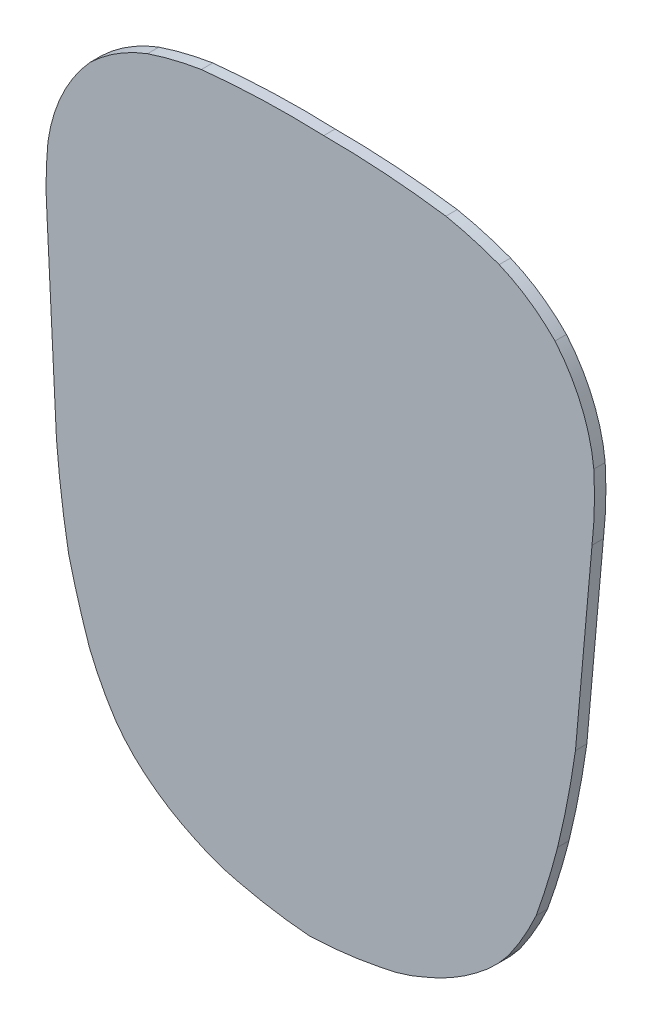
ISO-10303-21;
HEADER;
FILE_DESCRIPTION(('STEP AP214'),'2;1');
FILE_NAME('part.step','',(''),(''),'','','');
FILE_SCHEMA(('AUTOMOTIVE_DESIGN { 1 0 10303 214 1 1 1 1 }'));
ENDSEC;
DATA;
#1=APPLICATION_CONTEXT('core data for automotive mechanical design processes');
#2=APPLICATION_PROTOCOL_DEFINITION('international standard','automotive_design',2000,#1);
#3=PRODUCT_CONTEXT('',#1,'mechanical');
#4=PRODUCT('Part','Part','',(#3));
#5=PRODUCT_RELATED_PRODUCT_CATEGORY('part','',(#4));
#6=PRODUCT_DEFINITION_FORMATION('','',#4);
#7=PRODUCT_DEFINITION_CONTEXT('part definition',#1,'design');
#8=PRODUCT_DEFINITION('design','',#6,#7);
#9=PRODUCT_DEFINITION_SHAPE('','',#8);
#10=(LENGTH_UNIT() NAMED_UNIT(*) SI_UNIT(.MILLI.,.METRE.));
#11=(NAMED_UNIT(*) PLANE_ANGLE_UNIT() SI_UNIT($,.RADIAN.));
#12=(NAMED_UNIT(*) SI_UNIT($,.STERADIAN.) SOLID_ANGLE_UNIT());
#13=UNCERTAINTY_MEASURE_WITH_UNIT(LENGTH_MEASURE(1.E-05),#10,'distance_accuracy_value','');
#14=(GEOMETRIC_REPRESENTATION_CONTEXT(3) GLOBAL_UNCERTAINTY_ASSIGNED_CONTEXT((#13)) GLOBAL_UNIT_ASSIGNED_CONTEXT((#10,
#11,#12)) REPRESENTATION_CONTEXT('',''));
#15=CARTESIAN_POINT('',(0.,0.,0.));
#16=DIRECTION('',(0.,0.,1.));
#17=DIRECTION('',(1.,0.,0.));
#18=AXIS2_PLACEMENT_3D('',#15,#16,#17);
#19=CARTESIAN_POINT('',(-2.87645068487033,-22.2307778413904,43.1510965279302));
#20=DIRECTION('',(0.,0.,1.));
#21=DIRECTION('',(0.0193548335692301,0.999812677663925,0.));
#22=AXIS2_PLACEMENT_3D('',#19,#20,#21);
#23=PLANE('',#22);
#24=CARTESIAN_POINT('',(3.40605421210527,8.0200148488719,43.15109652793));
#25=DIRECTION('',(0.,0.,-1.));
#26=DIRECTION('',(-0.0193548335692301,-0.999812677663925,0.));
#27=AXIS2_PLACEMENT_3D('',#24,#25,#26);
#28=CIRCLE('',#27,7.43643173112);
#29=CARTESIAN_POINT('',(8.74976189327227,13.1916011731872,43.15109652793));
#30=VERTEX_POINT('',#29);
#31=CARTESIAN_POINT('',(6.29473617833653,14.8724621043842,43.1510965279299));
#32=VERTEX_POINT('',#31);
#33=EDGE_CURVE('E399',#30,#32,#28,.F.);
#34=ORIENTED_EDGE('',*,*,#33,.F.);
#35=CARTESIAN_POINT('',(3.11803650286176,8.43130453548574,43.1510965279299));
#36=DIRECTION('',(0.,0.,-1.));
#37=DIRECTION('',(-0.0193548335692301,-0.999812677663925,0.));
#38=AXIS2_PLACEMENT_3D('',#35,#36,#37);
#39=CIRCLE('',#38,7.3740595978);
#40=CARTESIAN_POINT('',(10.4553019723892,9.16702892789541,43.1510965279302));
#41=VERTEX_POINT('',#40);
#42=EDGE_CURVE('E194',#41,#30,#39,.F.);
#43=ORIENTED_EDGE('',*,*,#42,.F.);
#44=CARTESIAN_POINT('',(-6.32552371849111,8.14421174061843,43.1510965279296));
#45=DIRECTION('',(0.,0.,-1.));
#46=DIRECTION('',(-0.0193548335692301,-0.999812677663925,0.));
#47=AXIS2_PLACEMENT_3D('',#44,#45,#46);
#48=CIRCLE('',#47,16.81196793556);
#49=CARTESIAN_POINT('',(10.3766044314371,6.22557130278919,43.1510965279302));
#50=VERTEX_POINT('',#49);
#51=EDGE_CURVE('E20',#50,#41,#48,.F.);
#52=ORIENTED_EDGE('',*,*,#51,.F.);
#53=DIRECTION('',(-0.0886995040357044,-0.996058431008854,0.));
#54=VECTOR('',#53,1.);
#55=CARTESIAN_POINT('',(10.3766044314371,6.22557130278921,43.1510965279302));
#56=LINE('',#55,#54);
#57=CARTESIAN_POINT('',(9.64811099468465,-1.95510611475086,43.1510965279302));
#58=VERTEX_POINT('',#57);
#59=EDGE_CURVE('E193',#50,#58,#56,.T.);
#60=ORIENTED_EDGE('',*,*,#59,.T.);
#61=CARTESIAN_POINT('',(-31.2814474166913,3.80134354731974,43.1510965279289));
#62=DIRECTION('',(0.,0.,-1.));
#63=DIRECTION('',(-0.0193548335692301,-0.999812677663925,0.));
#64=AXIS2_PLACEMENT_3D('',#61,#62,#63);
#65=CIRCLE('',#64,41.33237791928);
#66=CARTESIAN_POINT('',(8.86403234955431,-6.0325732105216,43.1510965279303));
#67=VERTEX_POINT('',#66);
#68=EDGE_CURVE('E206',#67,#58,#65,.F.);
#69=ORIENTED_EDGE('',*,*,#68,.F.);
#70=CARTESIAN_POINT('',(-24.9737606237932,2.68335405814096,43.1510965279291));
#71=DIRECTION('',(0.,0.,-1.));
#72=DIRECTION('',(-0.0193548335692301,-0.999812677663925,0.));
#73=AXIS2_PLACEMENT_3D('',#70,#71,#72);
#74=CIRCLE('',#73,34.94228987144);
#75=CARTESIAN_POINT('',(7.9194767814797,-9.1064107597041,43.1510965279303));
#76=VERTEX_POINT('',#75);
#77=EDGE_CURVE('E319',#76,#67,#74,.F.);
#78=ORIENTED_EDGE('',*,*,#77,.F.);
#79=CARTESIAN_POINT('',(-3.58067037627316,-3.93497982202898,43.1510965279299));
#80=DIRECTION('',(0.,0.,-1.));
#81=DIRECTION('',(-0.0193548335692301,-0.999812677663925,0.));
#82=AXIS2_PLACEMENT_3D('',#79,#80,#81);
#83=CIRCLE('',#82,12.60940452968);
#84=CARTESIAN_POINT('',(6.69776683055133,-11.2391437836662,43.1510965279303));
#85=VERTEX_POINT('',#84);
#86=EDGE_CURVE('E323',#85,#76,#83,.F.);
#87=ORIENTED_EDGE('',*,*,#86,.F.);
#88=CARTESIAN_POINT('',(1.10266886694127,-6.86934474010801,43.15109652793));
#89=DIRECTION('',(0.,0.,-1.));
#90=DIRECTION('',(-0.0193548335692301,-0.999812677663925,0.));
#91=AXIS2_PLACEMENT_3D('',#88,#89,#90);
#92=CIRCLE('',#91,7.09931439672);
#93=CARTESIAN_POINT('',(5.3008399811585,-12.5943446701716,43.1510965279303));
#94=VERTEX_POINT('',#93);
#95=EDGE_CURVE('E327',#94,#85,#92,.F.);
#96=ORIENTED_EDGE('',*,*,#95,.F.);
#97=CARTESIAN_POINT('',(-0.638723059391969,-4.83953730632281,43.15109652793));
#98=DIRECTION('',(0.,0.,-1.));
#99=DIRECTION('',(-0.0193548335692301,-0.999812677663925,0.));
#100=AXIS2_PLACEMENT_3D('',#97,#98,#99);
#101=CIRCLE('',#100,9.76808304444);
#102=CARTESIAN_POINT('',(3.02325465351666,-13.8952187049386,43.1510965279302));
#103=VERTEX_POINT('',#102);
#104=EDGE_CURVE('E331',#103,#94,#101,.F.);
#105=ORIENTED_EDGE('',*,*,#104,.F.);
#106=CARTESIAN_POINT('',(-0.207770559998263,-6.83732878190931,43.15109652793));
#107=DIRECTION('',(0.,0.,-1.));
#108=DIRECTION('',(-0.0193548335692301,-0.999812677663925,0.));
#109=AXIS2_PLACEMENT_3D('',#106,#107,#108);
#110=CIRCLE('',#109,7.76230211316);
#111=CARTESIAN_POINT('',(1.11765382111094,-14.4856347581324,43.1510965279302));
#112=VERTEX_POINT('',#111);
#113=EDGE_CURVE('E335',#112,#103,#110,.F.);
#114=ORIENTED_EDGE('',*,*,#113,.F.);
#115=CARTESIAN_POINT('',(-2.80966912930602,4.75500909683415,43.1510965279298));
#116=DIRECTION('',(0.,0.,-1.));
#117=DIRECTION('',(-0.0193548335692301,-0.999812677663925,0.));
#118=AXIS2_PLACEMENT_3D('',#115,#116,#117);
#119=CIRCLE('',#118,19.6373684976);
#120=CARTESIAN_POINT('',(-2.0152683231092,-14.8662846645274,43.1510965279301));
#121=VERTEX_POINT('',#120);
#122=EDGE_CURVE('E339',#121,#112,#119,.F.);
#123=ORIENTED_EDGE('',*,*,#122,.F.);
#124=CARTESIAN_POINT('',(-0.523207579480698,4.71400533480683,43.1510965279299));
#125=DIRECTION('',(0.,0.,-1.));
#126=DIRECTION('',(-0.0193548335692301,-0.999812677663925,0.));
#127=AXIS2_PLACEMENT_3D('',#124,#125,#126);
#128=CIRCLE('',#127,19.63705684976);
#129=CARTESIAN_POINT('',(-5.17633782189568,-14.3637927736707,43.15109652793));
#130=VERTEX_POINT('',#129);
#131=EDGE_CURVE('E343',#130,#121,#128,.F.);
#132=ORIENTED_EDGE('',*,*,#131,.F.);
#133=CARTESIAN_POINT('',(-3.55589855490564,-6.77251418057686,43.1510965279299));
#134=DIRECTION('',(0.,0.,-1.));
#135=DIRECTION('',(-0.0193548335692301,-0.999812677663925,0.));
#136=AXIS2_PLACEMENT_3D('',#133,#134,#135);
#137=CIRCLE('',#136,7.76230211316);
#138=CARTESIAN_POINT('',(-7.05766041396093,-13.7000677154428,43.1510965279299));
#139=VERTEX_POINT('',#138);
#140=EDGE_CURVE('E347',#139,#130,#137,.F.);
#141=ORIENTED_EDGE('',*,*,#140,.F.);
#142=CARTESIAN_POINT('',(-3.04794957670783,-4.79289839153911,43.1510965279299));
#143=DIRECTION('',(0.,0.,-1.));
#144=DIRECTION('',(-0.0193548335692301,-0.999812677663925,0.));
#145=AXIS2_PLACEMENT_3D('',#142,#143,#144);
#146=CIRCLE('',#145,9.76808304444);
#147=CARTESIAN_POINT('',(-9.28319236302841,-12.3120202657152,43.1510965279298));
#148=VERTEX_POINT('',#147);
#149=EDGE_CURVE('E351',#148,#139,#146,.F.);
#150=ORIENTED_EDGE('',*,*,#149,.F.);
#151=CARTESIAN_POINT('',(-4.76167465689602,-6.83879977530856,43.1510965279299));
#152=DIRECTION('',(0.,0.,-1.));
#153=DIRECTION('',(-0.0193548335692301,-0.999812677663925,0.));
#154=AXIS2_PLACEMENT_3D('',#151,#152,#153);
#155=CIRCLE('',#154,7.09931439672);
#156=CARTESIAN_POINT('',(-10.5813963887555,-10.9046457963967,43.1510965279297));
#157=VERTEX_POINT('',#156);
#158=EDGE_CURVE('E355',#157,#148,#155,.F.);
#159=ORIENTED_EDGE('',*,*,#158,.F.);
#160=CARTESIAN_POINT('',(-0.0279711922389993,-4.00375460651079,43.15109652793));
#161=DIRECTION('',(0.,0.,-1.));
#162=DIRECTION('',(-0.0193548335692301,-0.999812677663925,0.));
#163=AXIS2_PLACEMENT_3D('',#160,#161,#162);
#164=CIRCLE('',#163,12.60940452968);
#165=CARTESIAN_POINT('',(-11.7196490905641,-8.726227530195,43.1510965279297));
#166=VERTEX_POINT('',#165);
#167=EDGE_CURVE('E359',#166,#157,#164,.F.);
#168=ORIENTED_EDGE('',*,*,#167,.F.);
#169=CARTESIAN_POINT('',(21.3074102324665,2.68328490166436,43.1510965279306));
#170=DIRECTION('',(0.,0.,-1.));
#171=DIRECTION('',(-0.0193548335692301,-0.999812677663925,0.));
#172=AXIS2_PLACEMENT_3D('',#169,#170,#171);
#173=CIRCLE('',#172,34.94228987144);
#174=CARTESIAN_POINT('',(-12.6348799299237,-5.61638738053107,43.1510965279296));
#175=VERTEX_POINT('',#174);
#176=EDGE_CURVE('E363',#175,#166,#173,.F.);
#177=ORIENTED_EDGE('',*,*,#176,.F.);
#178=CARTESIAN_POINT('',(28.0310735031442,1.7758853310058,43.1510965279308));
#179=DIRECTION('',(0.,0.,-1.));
#180=DIRECTION('',(-0.0193548335692301,-0.999812677663925,0.));
#181=AXIS2_PLACEMENT_3D('',#178,#179,#180);
#182=CIRCLE('',#181,41.33237791928);
#183=CARTESIAN_POINT('',(-13.1702154109104,-1.51337845938613,43.1510965279295));
#184=VERTEX_POINT('',#183);
#185=EDGE_CURVE('E367',#184,#175,#182,.F.);
#186=ORIENTED_EDGE('',*,*,#185,.F.);
#187=DIRECTION('',(-0.0500831809567766,0.998745050042928,0.));
#188=VECTOR('',#187,1.);
#189=CARTESIAN_POINT('',(-13.1702154109104,-1.51337845938573,43.1510965279295));
#190=LINE('',#189,#188);
#191=CARTESIAN_POINT('',(-13.5815510662261,6.68936429385884,43.1510965279294));
#192=VERTEX_POINT('',#191);
#193=EDGE_CURVE('E218',#184,#192,#190,.T.);
#194=ORIENTED_EDGE('',*,*,#193,.T.);
#195=CARTESIAN_POINT('',(3.18231954948565,7.96015453853935,43.1510965279299));
#196=DIRECTION('',(0.,0.,-1.));
#197=DIRECTION('',(-0.0193548335692301,-0.999812677663925,0.));
#198=AXIS2_PLACEMENT_3D('',#195,#196,#197);
#199=CIRCLE('',#198,16.81196793556);
#200=CARTESIAN_POINT('',(-13.5463481289567,9.63166390750378,43.1510965279294));
#201=VERTEX_POINT('',#200);
#202=EDGE_CURVE('E222',#201,#192,#199,.F.);
#203=ORIENTED_EDGE('',*,*,#202,.F.);
#204=CARTESIAN_POINT('',(-6.24305419079957,8.61252083374835,43.1510965279296));
#205=DIRECTION('',(0.,0.,-1.));
#206=DIRECTION('',(-0.0193548335692301,-0.999812677663925,0.));
#207=AXIS2_PLACEMENT_3D('',#204,#205,#206);
#208=CIRCLE('',#207,7.3740595978);
#209=CARTESIAN_POINT('',(-11.6863252040828,13.5872123445716,43.1510965279294));
#210=VERTEX_POINT('',#209);
#211=EDGE_CURVE('E375',#210,#201,#208,.F.);
#212=ORIENTED_EDGE('',*,*,#211,.F.);
#213=CARTESIAN_POINT('',(-6.54677401618405,8.21268627443511,43.1510965279296));
#214=DIRECTION('',(0.,0.,-1.));
#215=DIRECTION('',(-0.0193548335692301,-0.999812677663925,0.));
#216=AXIS2_PLACEMENT_3D('',#213,#214,#215);
#217=CIRCLE('',#216,7.43643173112);
#218=CARTESIAN_POINT('',(-9.16808546254474,15.17179851615,43.1510965279294));
#219=VERTEX_POINT('',#218);
#220=EDGE_CURVE('E379',#219,#210,#217,.F.);
#221=ORIENTED_EDGE('',*,*,#220,.F.);
#222=CARTESIAN_POINT('',(-4.43670572158524,1.02428534892838,43.1510965279298));
#223=DIRECTION('',(0.,0.,-1.));
#224=DIRECTION('',(-0.0193548335692301,-0.999812677663925,0.));
#225=AXIS2_PLACEMENT_3D('',#222,#223,#224);
#226=CIRCLE('',#225,14.91771038296);
#227=CARTESIAN_POINT('',(-6.80003650135285,15.7536013783737,43.1510965279295));
#228=VERTEX_POINT('',#227);
#229=EDGE_CURVE('E383',#228,#219,#226,.F.);
#230=ORIENTED_EDGE('',*,*,#229,.F.);
#231=CARTESIAN_POINT('',(-2.87645068487033,-22.2307778413904,43.1510965279302));
#232=DIRECTION('',(0.,0.,-1.));
#233=DIRECTION('',(-0.0193548335692301,-0.999812677663925,0.));
#234=AXIS2_PLACEMENT_3D('',#231,#232,#233);
#235=CIRCLE('',#234,38.18648439396);
#236=CARTESIAN_POINT('',(-1.41914055333825,15.9278887698879,43.1510965279297));
#237=VERTEX_POINT('',#236);
#238=EDGE_CURVE('E387',#237,#228,#235,.F.);
#239=ORIENTED_EDGE('',*,*,#238,.F.);
#240=CARTESIAN_POINT('',(-1.43975485684221,-22.2585901013477,43.1510965279302));
#241=DIRECTION('',(0.,0.,-1.));
#242=DIRECTION('',(-0.0193548335692301,-0.999812677663925,0.));
#243=AXIS2_PLACEMENT_3D('',#240,#241,#242);
#244=CIRCLE('',#243,38.186484435371);
#245=CARTESIAN_POINT('',(3.95097858118645,15.5454782846469,43.1510965279299));
#246=VERTEX_POINT('',#245);
#247=EDGE_CURVE('E391',#246,#237,#244,.F.);
#248=ORIENTED_EDGE('',*,*,#247,.F.);
#249=CARTESIAN_POINT('',(1.019358338455,0.918664351931352,43.15109652793));
#250=DIRECTION('',(0.,0.,-1.));
#251=DIRECTION('',(-0.0193548335692301,-0.999812677663925,0.));
#252=AXIS2_PLACEMENT_3D('',#249,#250,#251);
#253=CIRCLE('',#252,14.91771038296);
#254=EDGE_CURVE('E395',#32,#246,#253,.F.);
#255=ORIENTED_EDGE('',*,*,#254,.F.);
#256=EDGE_LOOP('',(#34,#43,#52,#60,#69,#78,#87,#96,#105,#114,#123,#132,#141,#150,#159,#168,#177,
#186,#194,#203,#212,#221,#230,#239,#248,#255));
#257=FACE_BOUND('',#256,.T.);
#258=ADVANCED_FACE('F17',(#257),#23,.F.);
#259=CARTESIAN_POINT('',(-6.32552371849112,8.14421174061844,43.5320965279296));
#260=DIRECTION('',(0.,0.,-1.));
#261=DIRECTION('',(-0.0193548335692301,-0.999812677663925,0.));
#262=AXIS2_PLACEMENT_3D('',#259,#260,#261);
#263=CYLINDRICAL_SURFACE('',#262,16.81196793556);
#264=DIRECTION('',(0.,0.,-1.));
#265=VECTOR('',#264,1.);
#266=CARTESIAN_POINT('',(10.4553019723892,9.16702892789546,43.5320965279302));
#267=LINE('',#266,#265);
#268=CARTESIAN_POINT('',(10.4553019723892,9.16702892789545,43.6520965279302));
#269=VERTEX_POINT('',#268);
#270=EDGE_CURVE('E198',#269,#41,#267,.T.);
#271=ORIENTED_EDGE('',*,*,#270,.F.);
#272=CARTESIAN_POINT('',(-6.32552371849113,8.14421174061844,43.6520965279296));
#273=DIRECTION('',(0.,0.,-1.));
#274=DIRECTION('',(-0.0193548335692301,-0.999812677663925,0.));
#275=AXIS2_PLACEMENT_3D('',#272,#273,#274);
#276=CIRCLE('',#275,16.81196793556);
#277=CARTESIAN_POINT('',(10.3766044314371,6.22557130278932,43.6520965279302));
#278=VERTEX_POINT('',#277);
#279=EDGE_CURVE('E203',#278,#269,#276,.F.);
#280=ORIENTED_EDGE('',*,*,#279,.F.);
#281=DIRECTION('',(0.,0.,1.));
#282=VECTOR('',#281,1.);
#283=CARTESIAN_POINT('',(10.3766044314371,6.22557130278923,43.5320965279302));
#284=LINE('',#283,#282);
#285=EDGE_CURVE('E200',#278,#50,#284,.F.);
#286=ORIENTED_EDGE('',*,*,#285,.T.);
#287=ORIENTED_EDGE('',*,*,#51,.T.);
#288=EDGE_LOOP('',(#271,#280,#286,#287));
#289=FACE_BOUND('',#288,.T.);
#290=ADVANCED_FACE('F201',(#289),#263,.T.);
#291=CARTESIAN_POINT('',(3.11803650286175,8.43130453548575,43.5320965279299));
#292=DIRECTION('',(0.,0.,-1.));
#293=DIRECTION('',(-0.0193548335692301,-0.999812677663925,0.));
#294=AXIS2_PLACEMENT_3D('',#291,#292,#293);
#295=CYLINDRICAL_SURFACE('',#294,7.3740595978);
#296=DIRECTION('',(0.,0.,-1.));
#297=VECTOR('',#296,1.);
#298=CARTESIAN_POINT('',(8.74976189327226,13.1916011731872,43.53209652793));
#299=LINE('',#298,#297);
#300=CARTESIAN_POINT('',(8.74976189327226,13.1916011731872,43.65209652793));
#301=VERTEX_POINT('',#300);
#302=EDGE_CURVE('E401',#301,#30,#299,.T.);
#303=ORIENTED_EDGE('',*,*,#302,.F.);
#304=CARTESIAN_POINT('',(3.11803650286175,8.43130453548575,43.6520965279299));
#305=DIRECTION('',(0.,0.,-1.));
#306=DIRECTION('',(-0.0193548335692301,-0.999812677663925,0.));
#307=AXIS2_PLACEMENT_3D('',#304,#305,#306);
#308=CIRCLE('',#307,7.3740595978);
#309=EDGE_CURVE('E310',#269,#301,#308,.F.);
#310=ORIENTED_EDGE('',*,*,#309,.F.);
#311=ORIENTED_EDGE('',*,*,#270,.T.);
#312=ORIENTED_EDGE('',*,*,#42,.T.);
#313=EDGE_LOOP('',(#303,#310,#311,#312));
#314=FACE_BOUND('',#313,.T.);
#315=ADVANCED_FACE('F408',(#314),#295,.T.);
#316=CARTESIAN_POINT('',(3.40605421210526,8.02001484887191,43.53209652793));
#317=DIRECTION('',(0.,0.,-1.));
#318=DIRECTION('',(-0.0193548335692301,-0.999812677663925,0.));
#319=AXIS2_PLACEMENT_3D('',#316,#317,#318);
#320=CYLINDRICAL_SURFACE('',#319,7.43643173112);
#321=DIRECTION('',(0.,0.,-1.));
#322=VECTOR('',#321,1.);
#323=CARTESIAN_POINT('',(6.29473617833652,14.8724621043842,43.5320965279299));
#324=LINE('',#323,#322);
#325=CARTESIAN_POINT('',(6.29473617833651,14.8724621043842,43.6520965279299));
#326=VERTEX_POINT('',#325);
#327=EDGE_CURVE('E398',#326,#32,#324,.T.);
#328=ORIENTED_EDGE('',*,*,#327,.F.);
#329=CARTESIAN_POINT('',(3.40605421210526,8.02001484887191,43.6520965279299));
#330=DIRECTION('',(0.,0.,-1.));
#331=DIRECTION('',(-0.0193548335692301,-0.999812677663925,0.));
#332=AXIS2_PLACEMENT_3D('',#329,#330,#331);
#333=CIRCLE('',#332,7.43643173112);
#334=EDGE_CURVE('E306',#301,#326,#333,.F.);
#335=ORIENTED_EDGE('',*,*,#334,.F.);
#336=ORIENTED_EDGE('',*,*,#302,.T.);
#337=ORIENTED_EDGE('',*,*,#33,.T.);
#338=EDGE_LOOP('',(#328,#335,#336,#337));
#339=FACE_BOUND('',#338,.T.);
#340=ADVANCED_FACE('F486',(#339),#320,.T.);
#341=CARTESIAN_POINT('',(1.01935833845499,0.918664351931359,43.53209652793));
#342=DIRECTION('',(0.,0.,-1.));
#343=DIRECTION('',(-0.0193548335692301,-0.999812677663925,0.));
#344=AXIS2_PLACEMENT_3D('',#341,#342,#343);
#345=CYLINDRICAL_SURFACE('',#344,14.91771038296);
#346=DIRECTION('',(0.,0.,-1.));
#347=VECTOR('',#346,1.);
#348=CARTESIAN_POINT('',(3.95097858118647,15.5454782846469,43.5320965279299));
#349=LINE('',#348,#347);
#350=CARTESIAN_POINT('',(3.95097858118645,15.5454782846469,43.6520965279299));
#351=VERTEX_POINT('',#350);
#352=EDGE_CURVE('E394',#351,#246,#349,.T.);
#353=ORIENTED_EDGE('',*,*,#352,.F.);
#354=CARTESIAN_POINT('',(1.01935833845498,0.91866435193136,43.6520965279299));
#355=DIRECTION('',(0.,0.,-1.));
#356=DIRECTION('',(-0.0193548335692301,-0.999812677663925,0.));
#357=AXIS2_PLACEMENT_3D('',#354,#355,#356);
#358=CIRCLE('',#357,14.91771038296);
#359=EDGE_CURVE('E302',#326,#351,#358,.F.);
#360=ORIENTED_EDGE('',*,*,#359,.F.);
#361=ORIENTED_EDGE('',*,*,#327,.T.);
#362=ORIENTED_EDGE('',*,*,#254,.T.);
#363=EDGE_LOOP('',(#353,#360,#361,#362));
#364=FACE_BOUND('',#363,.T.);
#365=ADVANCED_FACE('F482',(#364),#345,.T.);
#366=CARTESIAN_POINT('',(-1.43975485684222,-22.2585901013477,43.5320965279302));
#367=DIRECTION('',(0.,0.,-1.));
#368=DIRECTION('',(-0.0193548335692301,-0.999812677663925,0.));
#369=AXIS2_PLACEMENT_3D('',#366,#367,#368);
#370=CYLINDRICAL_SURFACE('',#369,38.186484435371);
#371=DIRECTION('',(0.,0.,-1.));
#372=VECTOR('',#371,1.);
#373=CARTESIAN_POINT('',(-1.41914055333816,15.9278887698879,43.5320965279297));
#374=LINE('',#373,#372);
#375=CARTESIAN_POINT('',(-1.41914055333827,15.9278887698879,43.6520965279297));
#376=VERTEX_POINT('',#375);
#377=EDGE_CURVE('E390',#376,#237,#374,.T.);
#378=ORIENTED_EDGE('',*,*,#377,.F.);
#379=CARTESIAN_POINT('',(-1.43975485684222,-22.2585901013477,43.6520965279302));
#380=DIRECTION('',(0.,0.,-1.));
#381=DIRECTION('',(-0.0193548335692301,-0.999812677663925,0.));
#382=AXIS2_PLACEMENT_3D('',#379,#380,#381);
#383=CIRCLE('',#382,38.186484435371);
#384=EDGE_CURVE('E298',#351,#376,#383,.F.);
#385=ORIENTED_EDGE('',*,*,#384,.F.);
#386=ORIENTED_EDGE('',*,*,#352,.T.);
#387=ORIENTED_EDGE('',*,*,#247,.T.);
#388=EDGE_LOOP('',(#378,#385,#386,#387));
#389=FACE_BOUND('',#388,.T.);
#390=ADVANCED_FACE('F491',(#389),#370,.T.);
#391=CARTESIAN_POINT('',(-2.87645068487034,-22.2307778413904,43.5320965279302));
#392=DIRECTION('',(0.,0.,-1.));
#393=DIRECTION('',(-0.0193548335692301,-0.999812677663925,0.));
#394=AXIS2_PLACEMENT_3D('',#391,#392,#393);
#395=CYLINDRICAL_SURFACE('',#394,38.18648439396);
#396=DIRECTION('',(0.,0.,-1.));
#397=VECTOR('',#396,1.);
#398=CARTESIAN_POINT('',(-6.80003650135287,15.7536013783737,43.5320965279295));
#399=LINE('',#398,#397);
#400=CARTESIAN_POINT('',(-6.80003650135289,15.7536013783737,43.6520965279295));
#401=VERTEX_POINT('',#400);
#402=EDGE_CURVE('E386',#401,#228,#399,.T.);
#403=ORIENTED_EDGE('',*,*,#402,.F.);
#404=CARTESIAN_POINT('',(-2.87645068487035,-22.2307778413904,43.6520965279302));
#405=DIRECTION('',(0.,0.,-1.));
#406=DIRECTION('',(-0.0193548335692301,-0.999812677663925,0.));
#407=AXIS2_PLACEMENT_3D('',#404,#405,#406);
#408=CIRCLE('',#407,38.18648439396);
#409=EDGE_CURVE('E294',#376,#401,#408,.F.);
#410=ORIENTED_EDGE('',*,*,#409,.F.);
#411=ORIENTED_EDGE('',*,*,#377,.T.);
#412=ORIENTED_EDGE('',*,*,#238,.T.);
#413=EDGE_LOOP('',(#403,#410,#411,#412));
#414=FACE_BOUND('',#413,.T.);
#415=ADVANCED_FACE('F495',(#414),#395,.T.);
#416=CARTESIAN_POINT('',(-4.43670572158525,1.02428534892838,43.5320965279298));
#417=DIRECTION('',(0.,0.,-1.));
#418=DIRECTION('',(-0.0193548335692301,-0.999812677663925,0.));
#419=AXIS2_PLACEMENT_3D('',#416,#417,#418);
#420=CYLINDRICAL_SURFACE('',#419,14.91771038296);
#421=DIRECTION('',(0.,0.,-1.));
#422=VECTOR('',#421,1.);
#423=CARTESIAN_POINT('',(-9.16808546254472,15.17179851615,43.5320965279294));
#424=LINE('',#423,#422);
#425=CARTESIAN_POINT('',(-9.16808546254475,15.17179851615,43.6520965279295));
#426=VERTEX_POINT('',#425);
#427=EDGE_CURVE('E382',#426,#219,#424,.T.);
#428=ORIENTED_EDGE('',*,*,#427,.F.);
#429=CARTESIAN_POINT('',(-4.43670572158526,1.02428534892839,43.6520965279298));
#430=DIRECTION('',(0.,0.,-1.));
#431=DIRECTION('',(-0.0193548335692301,-0.999812677663925,0.));
#432=AXIS2_PLACEMENT_3D('',#429,#430,#431);
#433=CIRCLE('',#432,14.91771038296);
#434=EDGE_CURVE('E290',#401,#426,#433,.F.);
#435=ORIENTED_EDGE('',*,*,#434,.F.);
#436=ORIENTED_EDGE('',*,*,#402,.T.);
#437=ORIENTED_EDGE('',*,*,#229,.T.);
#438=EDGE_LOOP('',(#428,#435,#436,#437));
#439=FACE_BOUND('',#438,.T.);
#440=ADVANCED_FACE('F497',(#439),#420,.T.);
#441=CARTESIAN_POINT('',(-6.54677401618406,8.21268627443511,43.5320965279296));
#442=DIRECTION('',(0.,0.,-1.));
#443=DIRECTION('',(-0.0193548335692301,-0.999812677663925,0.));
#444=AXIS2_PLACEMENT_3D('',#441,#442,#443);
#445=CYLINDRICAL_SURFACE('',#444,7.43643173112);
#446=DIRECTION('',(0.,0.,-1.));
#447=VECTOR('',#446,1.);
#448=CARTESIAN_POINT('',(-11.6863252040828,13.5872123445716,43.5320965279294));
#449=LINE('',#448,#447);
#450=CARTESIAN_POINT('',(-11.6863252040828,13.5872123445716,43.6520965279294));
#451=VERTEX_POINT('',#450);
#452=EDGE_CURVE('E378',#451,#210,#449,.T.);
#453=ORIENTED_EDGE('',*,*,#452,.F.);
#454=CARTESIAN_POINT('',(-6.54677401618406,8.21268627443511,43.6520965279296));
#455=DIRECTION('',(0.,0.,-1.));
#456=DIRECTION('',(-0.0193548335692301,-0.999812677663925,0.));
#457=AXIS2_PLACEMENT_3D('',#454,#455,#456);
#458=CIRCLE('',#457,7.43643173112);
#459=EDGE_CURVE('E286',#426,#451,#458,.F.);
#460=ORIENTED_EDGE('',*,*,#459,.F.);
#461=ORIENTED_EDGE('',*,*,#427,.T.);
#462=ORIENTED_EDGE('',*,*,#220,.T.);
#463=EDGE_LOOP('',(#453,#460,#461,#462));
#464=FACE_BOUND('',#463,.T.);
#465=ADVANCED_FACE('F501',(#464),#445,.T.);
#466=CARTESIAN_POINT('',(-6.24305419079959,8.61252083374836,43.5320965279296));
#467=DIRECTION('',(0.,0.,-1.));
#468=DIRECTION('',(-0.0193548335692301,-0.999812677663925,0.));
#469=AXIS2_PLACEMENT_3D('',#466,#467,#468);
#470=CYLINDRICAL_SURFACE('',#469,7.3740595978);
#471=DIRECTION('',(0.,0.,-1.));
#472=VECTOR('',#471,1.);
#473=CARTESIAN_POINT('',(-13.5463481289567,9.63166390750379,43.5320965279294));
#474=LINE('',#473,#472);
#475=CARTESIAN_POINT('',(-13.5463481289567,9.63166390750378,43.6520965279294));
#476=VERTEX_POINT('',#475);
#477=EDGE_CURVE('E374',#476,#201,#474,.T.);
#478=ORIENTED_EDGE('',*,*,#477,.F.);
#479=CARTESIAN_POINT('',(-6.24305419079959,8.61252083374836,43.6520965279296));
#480=DIRECTION('',(0.,0.,-1.));
#481=DIRECTION('',(-0.0193548335692301,-0.999812677663925,0.));
#482=AXIS2_PLACEMENT_3D('',#479,#480,#481);
#483=CIRCLE('',#482,7.3740595978);
#484=EDGE_CURVE('E282',#451,#476,#483,.F.);
#485=ORIENTED_EDGE('',*,*,#484,.F.);
#486=ORIENTED_EDGE('',*,*,#452,.T.);
#487=ORIENTED_EDGE('',*,*,#211,.T.);
#488=EDGE_LOOP('',(#478,#485,#486,#487));
#489=FACE_BOUND('',#488,.T.);
#490=ADVANCED_FACE('F506',(#489),#470,.T.);
#491=CARTESIAN_POINT('',(3.18231954948564,7.96015453853935,43.5320965279299));
#492=DIRECTION('',(0.,0.,-1.));
#493=DIRECTION('',(-0.0193548335692301,-0.999812677663925,0.));
#494=AXIS2_PLACEMENT_3D('',#491,#492,#493);
#495=CYLINDRICAL_SURFACE('',#494,16.81196793556);
#496=DIRECTION('',(0.,0.,1.));
#497=VECTOR('',#496,1.);
#498=CARTESIAN_POINT('',(-13.5815510662261,6.68936429385887,43.5320965279294));
#499=LINE('',#498,#497);
#500=CARTESIAN_POINT('',(-13.5815510662261,6.68936429385886,43.6520965279294));
#501=VERTEX_POINT('',#500);
#502=EDGE_CURVE('E221',#192,#501,#499,.T.);
#503=ORIENTED_EDGE('',*,*,#502,.T.);
#504=CARTESIAN_POINT('',(3.18231954948563,7.96015453853936,43.6520965279299));
#505=DIRECTION('',(0.,0.,-1.));
#506=DIRECTION('',(-0.0193548335692301,-0.999812677663925,0.));
#507=AXIS2_PLACEMENT_3D('',#504,#505,#506);
#508=CIRCLE('',#507,16.81196793556);
#509=EDGE_CURVE('E278',#476,#501,#508,.F.);
#510=ORIENTED_EDGE('',*,*,#509,.F.);
#511=ORIENTED_EDGE('',*,*,#477,.T.);
#512=ORIENTED_EDGE('',*,*,#202,.T.);
#513=EDGE_LOOP('',(#503,#510,#511,#512));
#514=FACE_BOUND('',#513,.T.);
#515=ADVANCED_FACE('F510',(#514),#495,.T.);
#516=CARTESIAN_POINT('',(-13.1702154109105,-1.51337845938573,43.5320965279295));
#517=DIRECTION('',(0.998745050042928,0.0500831809567766,0.));
#518=DIRECTION('',(-0.0500831809567766,0.998745050042928,0.));
#519=AXIS2_PLACEMENT_3D('',#516,#517,#518);
#520=PLANE('',#519);
#521=ORIENTED_EDGE('',*,*,#502,.F.);
#522=ORIENTED_EDGE('',*,*,#193,.F.);
#523=DIRECTION('',(0.,0.,-1.));
#524=VECTOR('',#523,1.);
#525=CARTESIAN_POINT('',(-13.1702154109104,-1.51337845938593,43.5320965279295));
#526=LINE('',#525,#524);
#527=CARTESIAN_POINT('',(-13.1702154109104,-1.51337845938599,43.6520965279296));
#528=VERTEX_POINT('',#527);
#529=EDGE_CURVE('E370',#528,#184,#526,.T.);
#530=ORIENTED_EDGE('',*,*,#529,.F.);
#531=DIRECTION('',(0.050083180956776,-0.998745050042928,0.));
#532=VECTOR('',#531,1.);
#533=CARTESIAN_POINT('',(-13.5815510662261,6.68936429385881,43.6520965279294));
#534=LINE('',#533,#532);
#535=EDGE_CURVE('E277',#501,#528,#534,.T.);
#536=ORIENTED_EDGE('',*,*,#535,.F.);
#537=EDGE_LOOP('',(#521,#522,#530,#536));
#538=FACE_BOUND('',#537,.T.);
#539=ADVANCED_FACE('F514',(#538),#520,.F.);
#540=CARTESIAN_POINT('',(28.0310735031442,1.77588533100581,43.5320965279308));
#541=DIRECTION('',(0.,0.,-1.));
#542=DIRECTION('',(-0.0193548335692301,-0.999812677663925,0.));
#543=AXIS2_PLACEMENT_3D('',#540,#541,#542);
#544=CYLINDRICAL_SURFACE('',#543,41.33237791928);
#545=DIRECTION('',(0.,0.,-1.));
#546=VECTOR('',#545,1.);
#547=CARTESIAN_POINT('',(-12.6348799299237,-5.61638738053115,43.5320965279296));
#548=LINE('',#547,#546);
#549=CARTESIAN_POINT('',(-12.6348799299238,-5.61638738053106,43.6520965279296));
#550=VERTEX_POINT('',#549);
#551=EDGE_CURVE('E366',#550,#175,#548,.T.);
#552=ORIENTED_EDGE('',*,*,#551,.F.);
#553=CARTESIAN_POINT('',(28.0310735031442,1.77588533100581,43.6520965279308));
#554=DIRECTION('',(0.,0.,-1.));
#555=DIRECTION('',(-0.0193548335692301,-0.999812677663925,0.));
#556=AXIS2_PLACEMENT_3D('',#553,#554,#555);
#557=CIRCLE('',#556,41.33237791928);
#558=EDGE_CURVE('E273',#528,#550,#557,.F.);
#559=ORIENTED_EDGE('',*,*,#558,.F.);
#560=ORIENTED_EDGE('',*,*,#529,.T.);
#561=ORIENTED_EDGE('',*,*,#185,.T.);
#562=EDGE_LOOP('',(#552,#559,#560,#561));
#563=FACE_BOUND('',#562,.T.);
#564=ADVANCED_FACE('F522',(#563),#544,.T.);
#565=CARTESIAN_POINT('',(21.3074102324665,2.68328490166436,43.5320965279306));
#566=DIRECTION('',(0.,0.,-1.));
#567=DIRECTION('',(-0.0193548335692301,-0.999812677663925,0.));
#568=AXIS2_PLACEMENT_3D('',#565,#566,#567);
#569=CYLINDRICAL_SURFACE('',#568,34.94228987144);
#570=DIRECTION('',(0.,0.,-1.));
#571=VECTOR('',#570,1.);
#572=CARTESIAN_POINT('',(-11.7196490905641,-8.72622753019495,43.5320965279297));
#573=LINE('',#572,#571);
#574=CARTESIAN_POINT('',(-11.7196490905641,-8.72622753019496,43.6520965279297));
#575=VERTEX_POINT('',#574);
#576=EDGE_CURVE('E362',#575,#166,#573,.T.);
#577=ORIENTED_EDGE('',*,*,#576,.F.);
#578=CARTESIAN_POINT('',(21.3074102324665,2.68328490166437,43.6520965279306));
#579=DIRECTION('',(0.,0.,-1.));
#580=DIRECTION('',(-0.0193548335692301,-0.999812677663925,0.));
#581=AXIS2_PLACEMENT_3D('',#578,#579,#580);
#582=CIRCLE('',#581,34.94228987144);
#583=EDGE_CURVE('E269',#550,#575,#582,.F.);
#584=ORIENTED_EDGE('',*,*,#583,.F.);
#585=ORIENTED_EDGE('',*,*,#551,.T.);
#586=ORIENTED_EDGE('',*,*,#176,.T.);
#587=EDGE_LOOP('',(#577,#584,#585,#586));
#588=FACE_BOUND('',#587,.T.);
#589=ADVANCED_FACE('F526',(#588),#569,.T.);
#590=CARTESIAN_POINT('',(-0.0279711922390115,-4.00375460651078,43.53209652793));
#591=DIRECTION('',(0.,0.,-1.));
#592=DIRECTION('',(-0.0193548335692301,-0.999812677663925,0.));
#593=AXIS2_PLACEMENT_3D('',#590,#591,#592);
#594=CYLINDRICAL_SURFACE('',#593,12.60940452968);
#595=DIRECTION('',(0.,0.,-1.));
#596=VECTOR('',#595,1.);
#597=CARTESIAN_POINT('',(-10.5813963887555,-10.9046457963967,43.5320965279297));
#598=LINE('',#597,#596);
#599=CARTESIAN_POINT('',(-10.5813963887555,-10.9046457963967,43.6520965279297));
#600=VERTEX_POINT('',#599);
#601=EDGE_CURVE('E358',#600,#157,#598,.T.);
#602=ORIENTED_EDGE('',*,*,#601,.F.);
#603=CARTESIAN_POINT('',(-0.0279711922390154,-4.00375460651078,43.65209652793));
#604=DIRECTION('',(0.,0.,-1.));
#605=DIRECTION('',(-0.0193548335692301,-0.999812677663925,0.));
#606=AXIS2_PLACEMENT_3D('',#603,#604,#605);
#607=CIRCLE('',#606,12.60940452968);
#608=EDGE_CURVE('E265',#575,#600,#607,.F.);
#609=ORIENTED_EDGE('',*,*,#608,.F.);
#610=ORIENTED_EDGE('',*,*,#576,.T.);
#611=ORIENTED_EDGE('',*,*,#167,.T.);
#612=EDGE_LOOP('',(#602,#609,#610,#611));
#613=FACE_BOUND('',#612,.T.);
#614=ADVANCED_FACE('F530',(#613),#594,.T.);
#615=CARTESIAN_POINT('',(-4.76167465689604,-6.83879977530855,43.5320965279299));
#616=DIRECTION('',(0.,0.,-1.));
#617=DIRECTION('',(-0.0193548335692301,-0.999812677663925,0.));
#618=AXIS2_PLACEMENT_3D('',#615,#616,#617);
#619=CYLINDRICAL_SURFACE('',#618,7.09931439672);
#620=DIRECTION('',(0.,0.,-1.));
#621=VECTOR('',#620,1.);
#622=CARTESIAN_POINT('',(-9.28319236302909,-12.3120202657146,43.5320965279298));
#623=LINE('',#622,#621);
#624=CARTESIAN_POINT('',(-9.28319236302837,-12.3120202657152,43.6520965279298));
#625=VERTEX_POINT('',#624);
#626=EDGE_CURVE('E354',#625,#148,#623,.T.);
#627=ORIENTED_EDGE('',*,*,#626,.F.);
#628=CARTESIAN_POINT('',(-4.76167465689604,-6.83879977530855,43.6520965279299));
#629=DIRECTION('',(0.,0.,-1.));
#630=DIRECTION('',(-0.0193548335692301,-0.999812677663925,0.));
#631=AXIS2_PLACEMENT_3D('',#628,#629,#630);
#632=CIRCLE('',#631,7.09931439672);
#633=EDGE_CURVE('E261',#600,#625,#632,.F.);
#634=ORIENTED_EDGE('',*,*,#633,.F.);
#635=ORIENTED_EDGE('',*,*,#601,.T.);
#636=ORIENTED_EDGE('',*,*,#158,.T.);
#637=EDGE_LOOP('',(#627,#634,#635,#636));
#638=FACE_BOUND('',#637,.T.);
#639=ADVANCED_FACE('F534',(#638),#619,.T.);
#640=CARTESIAN_POINT('',(-3.04794957670783,-4.79289839153911,43.5320965279299));
#641=DIRECTION('',(0.,0.,-1.));
#642=DIRECTION('',(-0.0193548335692301,-0.999812677663925,0.));
#643=AXIS2_PLACEMENT_3D('',#640,#641,#642);
#644=CYLINDRICAL_SURFACE('',#643,9.76808304444);
#645=DIRECTION('',(0.,0.,-1.));
#646=VECTOR('',#645,1.);
#647=CARTESIAN_POINT('',(-7.05766041396094,-13.7000677154428,43.5320965279299));
#648=LINE('',#647,#646);
#649=CARTESIAN_POINT('',(-7.05766041396095,-13.7000677154428,43.6520965279299));
#650=VERTEX_POINT('',#649);
#651=EDGE_CURVE('E350',#650,#139,#648,.T.);
#652=ORIENTED_EDGE('',*,*,#651,.F.);
#653=CARTESIAN_POINT('',(-3.04794957670784,-4.7928983915391,43.6520965279299));
#654=DIRECTION('',(0.,0.,-1.));
#655=DIRECTION('',(-0.0193548335692301,-0.999812677663925,0.));
#656=AXIS2_PLACEMENT_3D('',#653,#654,#655);
#657=CIRCLE('',#656,9.76808304444);
#658=EDGE_CURVE('E257',#625,#650,#657,.F.);
#659=ORIENTED_EDGE('',*,*,#658,.F.);
#660=ORIENTED_EDGE('',*,*,#626,.T.);
#661=ORIENTED_EDGE('',*,*,#149,.T.);
#662=EDGE_LOOP('',(#652,#659,#660,#661));
#663=FACE_BOUND('',#662,.T.);
#664=ADVANCED_FACE('F538',(#663),#644,.T.);
#665=CARTESIAN_POINT('',(-3.55589855490565,-6.77251418057685,43.5320965279299));
#666=DIRECTION('',(0.,0.,-1.));
#667=DIRECTION('',(-0.0193548335692301,-0.999812677663925,0.));
#668=AXIS2_PLACEMENT_3D('',#665,#666,#667);
#669=CYLINDRICAL_SURFACE('',#668,7.76230211316);
#670=DIRECTION('',(0.,0.,-1.));
#671=VECTOR('',#670,1.);
#672=CARTESIAN_POINT('',(-5.17633782189566,-14.3637927736707,43.53209652793));
#673=LINE('',#672,#671);
#674=CARTESIAN_POINT('',(-5.17633782189564,-14.3637927736707,43.6520965279299));
#675=VERTEX_POINT('',#674);
#676=EDGE_CURVE('E346',#675,#130,#673,.T.);
#677=ORIENTED_EDGE('',*,*,#676,.F.);
#678=CARTESIAN_POINT('',(-3.55589855490566,-6.77251418057685,43.6520965279299));
#679=DIRECTION('',(0.,0.,-1.));
#680=DIRECTION('',(-0.0193548335692301,-0.999812677663925,0.));
#681=AXIS2_PLACEMENT_3D('',#678,#679,#680);
#682=CIRCLE('',#681,7.76230211316);
#683=EDGE_CURVE('E253',#650,#675,#682,.F.);
#684=ORIENTED_EDGE('',*,*,#683,.F.);
#685=ORIENTED_EDGE('',*,*,#651,.T.);
#686=ORIENTED_EDGE('',*,*,#140,.T.);
#687=EDGE_LOOP('',(#677,#684,#685,#686));
#688=FACE_BOUND('',#687,.T.);
#689=ADVANCED_FACE('F542',(#688),#669,.T.);
#690=CARTESIAN_POINT('',(-0.52320757948071,4.71400533480683,43.5320965279299));
#691=DIRECTION('',(0.,0.,-1.));
#692=DIRECTION('',(-0.0193548335692301,-0.999812677663925,0.));
#693=AXIS2_PLACEMENT_3D('',#690,#691,#692);
#694=CYLINDRICAL_SURFACE('',#693,19.63705684976);
#695=DIRECTION('',(0.,0.,-1.));
#696=VECTOR('',#695,1.);
#697=CARTESIAN_POINT('',(-2.01526832310921,-14.8662846645274,43.5320965279301));
#698=LINE('',#697,#696);
#699=CARTESIAN_POINT('',(-2.01526832310922,-14.8662846645274,43.6520965279301));
#700=VERTEX_POINT('',#699);
#701=EDGE_CURVE('E342',#700,#121,#698,.T.);
#702=ORIENTED_EDGE('',*,*,#701,.F.);
#703=CARTESIAN_POINT('',(-0.523207579480714,4.71400533480683,43.6520965279299));
#704=DIRECTION('',(0.,0.,-1.));
#705=DIRECTION('',(-0.0193548335692301,-0.999812677663925,0.));
#706=AXIS2_PLACEMENT_3D('',#703,#704,#705);
#707=CIRCLE('',#706,19.63705684976);
#708=EDGE_CURVE('E249',#675,#700,#707,.F.);
#709=ORIENTED_EDGE('',*,*,#708,.F.);
#710=ORIENTED_EDGE('',*,*,#676,.T.);
#711=ORIENTED_EDGE('',*,*,#131,.T.);
#712=EDGE_LOOP('',(#702,#709,#710,#711));
#713=FACE_BOUND('',#712,.T.);
#714=ADVANCED_FACE('F546',(#713),#694,.T.);
#715=CARTESIAN_POINT('',(-2.80966912930603,4.75500909683415,43.5320965279298));
#716=DIRECTION('',(0.,0.,-1.));
#717=DIRECTION('',(-0.0193548335692301,-0.999812677663925,0.));
#718=AXIS2_PLACEMENT_3D('',#715,#716,#717);
#719=CYLINDRICAL_SURFACE('',#718,19.6373684976);
#720=DIRECTION('',(0.,0.,-1.));
#721=VECTOR('',#720,1.);
#722=CARTESIAN_POINT('',(1.11765382111095,-14.4856347581324,43.5320965279302));
#723=LINE('',#722,#721);
#724=CARTESIAN_POINT('',(1.11765382111094,-14.4856347581324,43.6520965279302));
#725=VERTEX_POINT('',#724);
#726=EDGE_CURVE('E338',#725,#112,#723,.T.);
#727=ORIENTED_EDGE('',*,*,#726,.F.);
#728=CARTESIAN_POINT('',(-2.80966912930604,4.75500909683415,43.6520965279298));
#729=DIRECTION('',(0.,0.,-1.));
#730=DIRECTION('',(-0.0193548335692301,-0.999812677663925,0.));
#731=AXIS2_PLACEMENT_3D('',#728,#729,#730);
#732=CIRCLE('',#731,19.6373684976);
#733=EDGE_CURVE('E245',#700,#725,#732,.F.);
#734=ORIENTED_EDGE('',*,*,#733,.F.);
#735=ORIENTED_EDGE('',*,*,#701,.T.);
#736=ORIENTED_EDGE('',*,*,#122,.T.);
#737=EDGE_LOOP('',(#727,#734,#735,#736));
#738=FACE_BOUND('',#737,.T.);
#739=ADVANCED_FACE('F550',(#738),#719,.T.);
#740=CARTESIAN_POINT('',(-0.207770559998276,-6.8373287819093,43.53209652793));
#741=DIRECTION('',(0.,0.,-1.));
#742=DIRECTION('',(-0.0193548335692301,-0.999812677663925,0.));
#743=AXIS2_PLACEMENT_3D('',#740,#741,#742);
#744=CYLINDRICAL_SURFACE('',#743,7.76230211316);
#745=DIRECTION('',(0.,0.,-1.));
#746=VECTOR('',#745,1.);
#747=CARTESIAN_POINT('',(3.02325465351665,-13.8952187049386,43.5320965279302));
#748=LINE('',#747,#746);
#749=CARTESIAN_POINT('',(3.02325465351664,-13.8952187049386,43.6520965279302));
#750=VERTEX_POINT('',#749);
#751=EDGE_CURVE('E334',#750,#103,#748,.T.);
#752=ORIENTED_EDGE('',*,*,#751,.F.);
#753=CARTESIAN_POINT('',(-0.20777055999828,-6.8373287819093,43.65209652793));
#754=DIRECTION('',(0.,0.,-1.));
#755=DIRECTION('',(-0.0193548335692301,-0.999812677663925,0.));
#756=AXIS2_PLACEMENT_3D('',#753,#754,#755);
#757=CIRCLE('',#756,7.76230211316);
#758=EDGE_CURVE('E241',#725,#750,#757,.F.);
#759=ORIENTED_EDGE('',*,*,#758,.F.);
#760=ORIENTED_EDGE('',*,*,#726,.T.);
#761=ORIENTED_EDGE('',*,*,#113,.T.);
#762=EDGE_LOOP('',(#752,#759,#760,#761));
#763=FACE_BOUND('',#762,.T.);
#764=ADVANCED_FACE('F554',(#763),#744,.T.);
#765=CARTESIAN_POINT('',(-0.638723059391981,-4.83953730632281,43.53209652793));
#766=DIRECTION('',(0.,0.,-1.));
#767=DIRECTION('',(-0.0193548335692301,-0.999812677663925,0.));
#768=AXIS2_PLACEMENT_3D('',#765,#766,#767);
#769=CYLINDRICAL_SURFACE('',#768,9.76808304444);
#770=DIRECTION('',(0.,0.,-1.));
#771=VECTOR('',#770,1.);
#772=CARTESIAN_POINT('',(5.30083998115846,-12.5943446701716,43.5320965279303));
#773=LINE('',#772,#771);
#774=CARTESIAN_POINT('',(5.30083998115849,-12.5943446701716,43.6520965279303));
#775=VERTEX_POINT('',#774);
#776=EDGE_CURVE('E330',#775,#94,#773,.T.);
#777=ORIENTED_EDGE('',*,*,#776,.F.);
#778=CARTESIAN_POINT('',(-0.638723059391985,-4.83953730632281,43.65209652793));
#779=DIRECTION('',(0.,0.,-1.));
#780=DIRECTION('',(-0.0193548335692301,-0.999812677663925,0.));
#781=AXIS2_PLACEMENT_3D('',#778,#779,#780);
#782=CIRCLE('',#781,9.76808304444);
#783=EDGE_CURVE('E238',#750,#775,#782,.F.);
#784=ORIENTED_EDGE('',*,*,#783,.F.);
#785=ORIENTED_EDGE('',*,*,#751,.T.);
#786=ORIENTED_EDGE('',*,*,#104,.T.);
#787=EDGE_LOOP('',(#777,#784,#785,#786));
#788=FACE_BOUND('',#787,.T.);
#789=ADVANCED_FACE('F558',(#788),#769,.T.);
#790=CARTESIAN_POINT('',(1.10266886694126,-6.86934474010801,43.53209652793));
#791=DIRECTION('',(0.,0.,-1.));
#792=DIRECTION('',(-0.0193548335692301,-0.999812677663925,0.));
#793=AXIS2_PLACEMENT_3D('',#790,#791,#792);
#794=CYLINDRICAL_SURFACE('',#793,7.09931439672);
#795=DIRECTION('',(0.,0.,-1.));
#796=VECTOR('',#795,1.);
#797=CARTESIAN_POINT('',(6.69776683055131,-11.2391437836662,43.5320965279303));
#798=LINE('',#797,#796);
#799=CARTESIAN_POINT('',(6.69776683055132,-11.2391437836662,43.6520965279303));
#800=VERTEX_POINT('',#799);
#801=EDGE_CURVE('E326',#800,#85,#798,.T.);
#802=ORIENTED_EDGE('',*,*,#801,.F.);
#803=CARTESIAN_POINT('',(1.10266886694125,-6.869344740108,43.65209652793));
#804=DIRECTION('',(0.,0.,-1.));
#805=DIRECTION('',(-0.0193548335692301,-0.999812677663925,0.));
#806=AXIS2_PLACEMENT_3D('',#803,#804,#805);
#807=CIRCLE('',#806,7.09931439672);
#808=EDGE_CURVE('E234',#775,#800,#807,.F.);
#809=ORIENTED_EDGE('',*,*,#808,.F.);
#810=ORIENTED_EDGE('',*,*,#776,.T.);
#811=ORIENTED_EDGE('',*,*,#95,.T.);
#812=EDGE_LOOP('',(#802,#809,#810,#811));
#813=FACE_BOUND('',#812,.T.);
#814=ADVANCED_FACE('F562',(#813),#794,.T.);
#815=CARTESIAN_POINT('',(-3.58067037627317,-3.93497982202897,43.5320965279299));
#816=DIRECTION('',(0.,0.,-1.));
#817=DIRECTION('',(-0.0193548335692301,-0.999812677663925,0.));
#818=AXIS2_PLACEMENT_3D('',#815,#816,#817);
#819=CYLINDRICAL_SURFACE('',#818,12.60940452968);
#820=DIRECTION('',(0.,0.,-1.));
#821=VECTOR('',#820,1.);
#822=CARTESIAN_POINT('',(7.9194767814797,-9.10641075970407,43.5320965279303));
#823=LINE('',#822,#821);
#824=CARTESIAN_POINT('',(7.9194767814797,-9.10641075970407,43.6520965279303));
#825=VERTEX_POINT('',#824);
#826=EDGE_CURVE('E322',#825,#76,#823,.T.);
#827=ORIENTED_EDGE('',*,*,#826,.F.);
#828=CARTESIAN_POINT('',(-3.58067037627317,-3.93497982202897,43.6520965279299));
#829=DIRECTION('',(0.,0.,-1.));
#830=DIRECTION('',(-0.0193548335692301,-0.999812677663925,0.));
#831=AXIS2_PLACEMENT_3D('',#828,#829,#830);
#832=CIRCLE('',#831,12.60940452968);
#833=EDGE_CURVE('E230',#800,#825,#832,.F.);
#834=ORIENTED_EDGE('',*,*,#833,.F.);
#835=ORIENTED_EDGE('',*,*,#801,.T.);
#836=ORIENTED_EDGE('',*,*,#86,.T.);
#837=EDGE_LOOP('',(#827,#834,#835,#836));
#838=FACE_BOUND('',#837,.T.);
#839=ADVANCED_FACE('F566',(#838),#819,.T.);
#840=CARTESIAN_POINT('',(-24.9737606237932,2.68335405814097,43.5320965279291));
#841=DIRECTION('',(0.,0.,-1.));
#842=DIRECTION('',(-0.0193548335692301,-0.999812677663925,0.));
#843=AXIS2_PLACEMENT_3D('',#840,#841,#842);
#844=CYLINDRICAL_SURFACE('',#843,34.94228987144);
#845=DIRECTION('',(0.,0.,-1.));
#846=VECTOR('',#845,1.);
#847=CARTESIAN_POINT('',(8.86403234955421,-6.03257321052196,43.5320965279303));
#848=LINE('',#847,#846);
#849=CARTESIAN_POINT('',(8.86403234955428,-6.03257321052163,43.6520965279303));
#850=VERTEX_POINT('',#849);
#851=EDGE_CURVE('E318',#850,#67,#848,.T.);
#852=ORIENTED_EDGE('',*,*,#851,.F.);
#853=CARTESIAN_POINT('',(-24.9737606237932,2.68335405814097,43.6520965279291));
#854=DIRECTION('',(0.,0.,-1.));
#855=DIRECTION('',(-0.0193548335692301,-0.999812677663925,0.));
#856=AXIS2_PLACEMENT_3D('',#853,#854,#855);
#857=CIRCLE('',#856,34.94228987144);
#858=EDGE_CURVE('E226',#825,#850,#857,.F.);
#859=ORIENTED_EDGE('',*,*,#858,.F.);
#860=ORIENTED_EDGE('',*,*,#826,.T.);
#861=ORIENTED_EDGE('',*,*,#77,.T.);
#862=EDGE_LOOP('',(#852,#859,#860,#861));
#863=FACE_BOUND('',#862,.T.);
#864=ADVANCED_FACE('F568',(#863),#844,.T.);
#865=CARTESIAN_POINT('',(-31.2814474166913,3.80134354731975,43.5320965279289));
#866=DIRECTION('',(0.,0.,-1.));
#867=DIRECTION('',(-0.0193548335692301,-0.999812677663925,0.));
#868=AXIS2_PLACEMENT_3D('',#865,#866,#867);
#869=CYLINDRICAL_SURFACE('',#868,41.33237791928);
#870=DIRECTION('',(0.,0.,1.));
#871=VECTOR('',#870,1.);
#872=CARTESIAN_POINT('',(9.64811099468465,-1.95510611475071,43.5320965279302));
#873=LINE('',#872,#871);
#874=CARTESIAN_POINT('',(9.64811099468463,-1.95510611475086,43.6520965279302));
#875=VERTEX_POINT('',#874);
#876=EDGE_CURVE('E36',#58,#875,#873,.T.);
#877=ORIENTED_EDGE('',*,*,#876,.T.);
#878=CARTESIAN_POINT('',(-31.2814474166913,3.80134354731975,43.6520965279289));
#879=DIRECTION('',(0.,0.,-1.));
#880=DIRECTION('',(-0.0193548335692301,-0.999812677663925,0.));
#881=AXIS2_PLACEMENT_3D('',#878,#879,#880);
#882=CIRCLE('',#881,41.33237791928);
#883=EDGE_CURVE('E27',#850,#875,#882,.F.);
#884=ORIENTED_EDGE('',*,*,#883,.F.);
#885=ORIENTED_EDGE('',*,*,#851,.T.);
#886=ORIENTED_EDGE('',*,*,#68,.T.);
#887=EDGE_LOOP('',(#877,#884,#885,#886));
#888=FACE_BOUND('',#887,.T.);
#889=ADVANCED_FACE('F414',(#888),#869,.T.);
#890=CARTESIAN_POINT('',(10.3766044314371,6.22557130278922,43.5320965279302));
#891=DIRECTION('',(-0.996058431008854,0.0886995040357044,0.));
#892=DIRECTION('',(-0.0886995040357044,-0.996058431008854,0.));
#893=AXIS2_PLACEMENT_3D('',#890,#891,#892);
#894=PLANE('',#893);
#895=ORIENTED_EDGE('',*,*,#876,.F.);
#896=ORIENTED_EDGE('',*,*,#59,.F.);
#897=ORIENTED_EDGE('',*,*,#285,.F.);
#898=DIRECTION('',(0.088699504035705,0.996058431008854,0.));
#899=VECTOR('',#898,1.);
#900=CARTESIAN_POINT('',(9.64811099468464,-1.95510611475078,43.6520965279302));
#901=LINE('',#900,#899);
#902=EDGE_CURVE('E11',#875,#278,#901,.T.);
#903=ORIENTED_EDGE('',*,*,#902,.F.);
#904=EDGE_LOOP('',(#895,#896,#897,#903));
#905=FACE_BOUND('',#904,.T.);
#906=ADVANCED_FACE('F208',(#905),#894,.F.);
#907=CARTESIAN_POINT('',(3.40605421210526,8.02001484887191,43.6520965279299));
#908=DIRECTION('',(0.,0.,1.));
#909=DIRECTION('',(0.0193548335692301,0.999812677663925,0.));
#910=AXIS2_PLACEMENT_3D('',#907,#908,#909);
#911=PLANE('',#910);
#912=ORIENTED_EDGE('',*,*,#883,.T.);
#913=ORIENTED_EDGE('',*,*,#902,.T.);
#914=ORIENTED_EDGE('',*,*,#279,.T.);
#915=ORIENTED_EDGE('',*,*,#309,.T.);
#916=ORIENTED_EDGE('',*,*,#334,.T.);
#917=ORIENTED_EDGE('',*,*,#359,.T.);
#918=ORIENTED_EDGE('',*,*,#384,.T.);
#919=ORIENTED_EDGE('',*,*,#409,.T.);
#920=ORIENTED_EDGE('',*,*,#434,.T.);
#921=ORIENTED_EDGE('',*,*,#459,.T.);
#922=ORIENTED_EDGE('',*,*,#484,.T.);
#923=ORIENTED_EDGE('',*,*,#509,.T.);
#924=ORIENTED_EDGE('',*,*,#535,.T.);
#925=ORIENTED_EDGE('',*,*,#558,.T.);
#926=ORIENTED_EDGE('',*,*,#583,.T.);
#927=ORIENTED_EDGE('',*,*,#608,.T.);
#928=ORIENTED_EDGE('',*,*,#633,.T.);
#929=ORIENTED_EDGE('',*,*,#658,.T.);
#930=ORIENTED_EDGE('',*,*,#683,.T.);
#931=ORIENTED_EDGE('',*,*,#708,.T.);
#932=ORIENTED_EDGE('',*,*,#733,.T.);
#933=ORIENTED_EDGE('',*,*,#758,.T.);
#934=ORIENTED_EDGE('',*,*,#783,.T.);
#935=ORIENTED_EDGE('',*,*,#808,.T.);
#936=ORIENTED_EDGE('',*,*,#833,.T.);
#937=ORIENTED_EDGE('',*,*,#858,.T.);
#938=EDGE_LOOP('',(#912,#913,#914,#915,#916,#917,#918,#919,#920,#921,#922,#923,#924,#925,#926,
#927,#928,#929,#930,#931,#932,#933,#934,#935,#936,#937));
#939=FACE_BOUND('',#938,.T.);
#940=ADVANCED_FACE('F411',(#939),#911,.T.);
#941=CLOSED_SHELL('',(#258,#290,#315,#340,#365,#390,#415,#440,#465,#490,#515,#539,#564,#589,
#614,#639,#664,#689,#714,#739,#764,#789,#814,#839,#864,#889,#906,#940));
#942=MANIFOLD_SOLID_BREP('B1',#941);
#943=ADVANCED_BREP_SHAPE_REPRESENTATION('',(#18,#942),#14);
#944=SHAPE_DEFINITION_REPRESENTATION(#9,#943);
ENDSEC;
END-ISO-10303-21;
